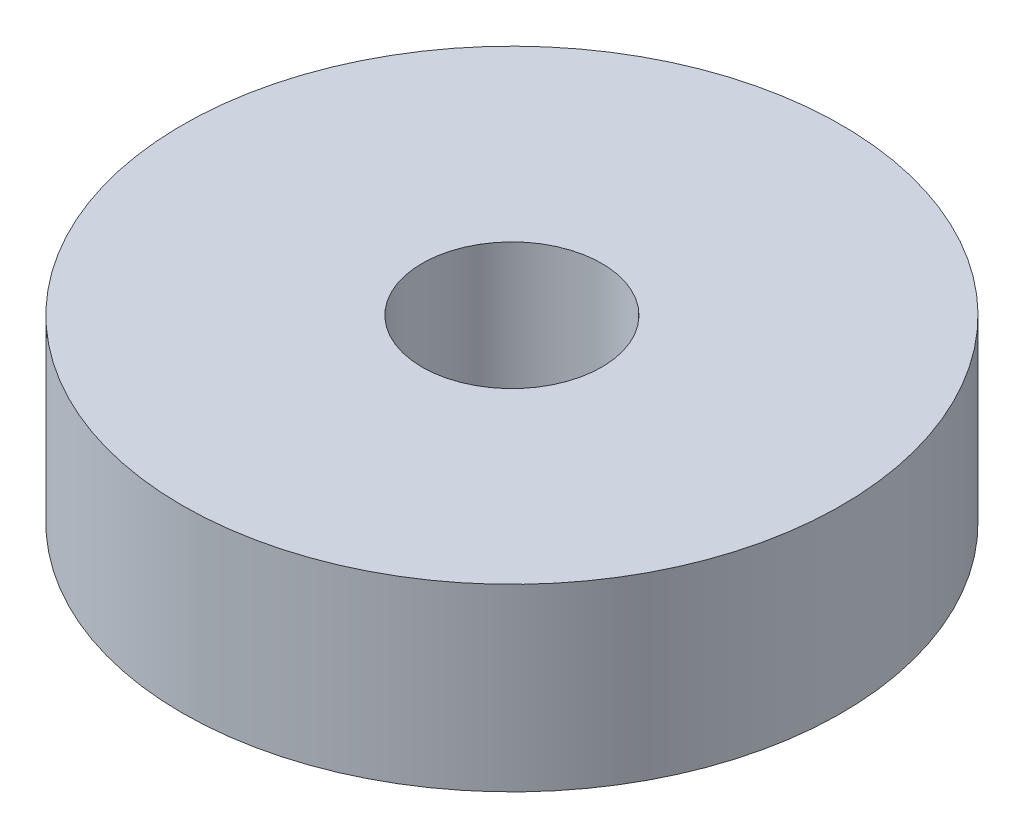
ISO-10303-21;
HEADER;
FILE_DESCRIPTION(('STEP AP214'),'2;1');
FILE_NAME('part.step','',(''),(''),'','','');
FILE_SCHEMA(('AUTOMOTIVE_DESIGN { 1 0 10303 214 1 1 1 1 }'));
ENDSEC;
DATA;
#1=APPLICATION_CONTEXT('core data for automotive mechanical design processes');
#2=APPLICATION_PROTOCOL_DEFINITION('international standard','automotive_design',2000,#1);
#3=PRODUCT_CONTEXT('',#1,'mechanical');
#4=PRODUCT('Part','Part','',(#3));
#5=PRODUCT_RELATED_PRODUCT_CATEGORY('part','',(#4));
#6=PRODUCT_DEFINITION_FORMATION('','',#4);
#7=PRODUCT_DEFINITION_CONTEXT('part definition',#1,'design');
#8=PRODUCT_DEFINITION('design','',#6,#7);
#9=PRODUCT_DEFINITION_SHAPE('','',#8);
#10=(LENGTH_UNIT() NAMED_UNIT(*) SI_UNIT(.MILLI.,.METRE.));
#11=(NAMED_UNIT(*) PLANE_ANGLE_UNIT() SI_UNIT($,.RADIAN.));
#12=(NAMED_UNIT(*) SI_UNIT($,.STERADIAN.) SOLID_ANGLE_UNIT());
#13=UNCERTAINTY_MEASURE_WITH_UNIT(LENGTH_MEASURE(1.E-05),#10,'distance_accuracy_value','');
#14=(GEOMETRIC_REPRESENTATION_CONTEXT(3) GLOBAL_UNCERTAINTY_ASSIGNED_CONTEXT((#13)) GLOBAL_UNIT_ASSIGNED_CONTEXT((#10,
#11,#12)) REPRESENTATION_CONTEXT('',''));
#15=CARTESIAN_POINT('',(0.,0.,0.));
#16=DIRECTION('',(0.,0.,1.));
#17=DIRECTION('',(1.,0.,0.));
#18=AXIS2_PLACEMENT_3D('',#15,#16,#17);
#19=CARTESIAN_POINT('',(0.,6.,0.));
#20=DIRECTION('',(0.,1.,0.));
#21=DIRECTION('',(0.,0.,1.));
#22=AXIS2_PLACEMENT_3D('',#19,#20,#21);
#23=PLANE('',#22);
#24=CARTESIAN_POINT('',(0.,6.,0.));
#25=DIRECTION('',(0.,1.,0.));
#26=DIRECTION('',(0.,0.,1.));
#27=AXIS2_PLACEMENT_3D('',#24,#25,#26);
#28=CIRCLE('',#27,11.);
#29=CARTESIAN_POINT('',(0.,6.,11.));
#30=VERTEX_POINT('',#29);
#31=EDGE_CURVE('E10',#30,#30,#28,.T.);
#32=ORIENTED_EDGE('',*,*,#31,.T.);
#33=EDGE_LOOP('',(#32));
#34=FACE_BOUND('',#33,.T.);
#35=CARTESIAN_POINT('',(0.,6.,0.));
#36=DIRECTION('',(0.,1.,0.));
#37=DIRECTION('',(0.,0.,1.));
#38=AXIS2_PLACEMENT_3D('',#35,#36,#37);
#39=CIRCLE('',#38,3.);
#40=CARTESIAN_POINT('',(0.,6.,3.));
#41=VERTEX_POINT('',#40);
#42=EDGE_CURVE('E48',#41,#41,#39,.T.);
#43=ORIENTED_EDGE('',*,*,#42,.F.);
#44=EDGE_LOOP('',(#43));
#45=FACE_BOUND('',#44,.T.);
#46=ADVANCED_FACE('F37',(#34,#45),#23,.T.);
#47=CARTESIAN_POINT('',(0.,0.,0.));
#48=DIRECTION('',(0.,1.,0.));
#49=DIRECTION('',(0.,0.,1.));
#50=AXIS2_PLACEMENT_3D('',#47,#48,#49);
#51=PLANE('',#50);
#52=CARTESIAN_POINT('',(0.,0.,0.));
#53=DIRECTION('',(0.,1.,0.));
#54=DIRECTION('',(0.,0.,1.));
#55=AXIS2_PLACEMENT_3D('',#52,#53,#54);
#56=CIRCLE('',#55,11.);
#57=CARTESIAN_POINT('',(0.,0.,11.));
#58=VERTEX_POINT('',#57);
#59=EDGE_CURVE('E41',#58,#58,#56,.T.);
#60=ORIENTED_EDGE('',*,*,#59,.F.);
#61=EDGE_LOOP('',(#60));
#62=FACE_BOUND('',#61,.T.);
#63=CARTESIAN_POINT('',(0.,0.,0.));
#64=DIRECTION('',(0.,1.,0.));
#65=DIRECTION('',(0.,0.,1.));
#66=AXIS2_PLACEMENT_3D('',#63,#64,#65);
#67=CIRCLE('',#66,3.);
#68=CARTESIAN_POINT('',(0.,0.,3.));
#69=VERTEX_POINT('',#68);
#70=EDGE_CURVE('E50',#69,#69,#67,.T.);
#71=ORIENTED_EDGE('',*,*,#70,.T.);
#72=EDGE_LOOP('',(#71));
#73=FACE_BOUND('',#72,.T.);
#74=ADVANCED_FACE('F60',(#62,#73),#51,.F.);
#75=CARTESIAN_POINT('',(0.,6.,0.));
#76=DIRECTION('',(0.,-1.,0.));
#77=DIRECTION('',(0.,0.,-1.));
#78=AXIS2_PLACEMENT_3D('',#75,#76,#77);
#79=CYLINDRICAL_SURFACE('',#78,11.);
#80=ORIENTED_EDGE('',*,*,#31,.F.);
#81=EDGE_LOOP('',(#80));
#82=FACE_BOUND('',#81,.T.);
#83=ORIENTED_EDGE('',*,*,#59,.T.);
#84=EDGE_LOOP('',(#83));
#85=FACE_BOUND('',#84,.T.);
#86=ADVANCED_FACE('F39',(#82,#85),#79,.T.);
#87=CARTESIAN_POINT('',(0.,6.,0.));
#88=DIRECTION('',(0.,-1.,0.));
#89=DIRECTION('',(0.,0.,-1.));
#90=AXIS2_PLACEMENT_3D('',#87,#88,#89);
#91=CYLINDRICAL_SURFACE('',#90,3.);
#92=ORIENTED_EDGE('',*,*,#42,.T.);
#93=EDGE_LOOP('',(#92));
#94=FACE_BOUND('',#93,.T.);
#95=ORIENTED_EDGE('',*,*,#70,.F.);
#96=EDGE_LOOP('',(#95));
#97=FACE_BOUND('',#96,.T.);
#98=ADVANCED_FACE('F56',(#94,#97),#91,.F.);
#99=CLOSED_SHELL('',(#46,#74,#86,#98));
#100=MANIFOLD_SOLID_BREP('B2',#99);
#101=ADVANCED_BREP_SHAPE_REPRESENTATION('',(#18,#100),#14);
#102=SHAPE_DEFINITION_REPRESENTATION(#9,#101);
ENDSEC;
END-ISO-10303-21;
